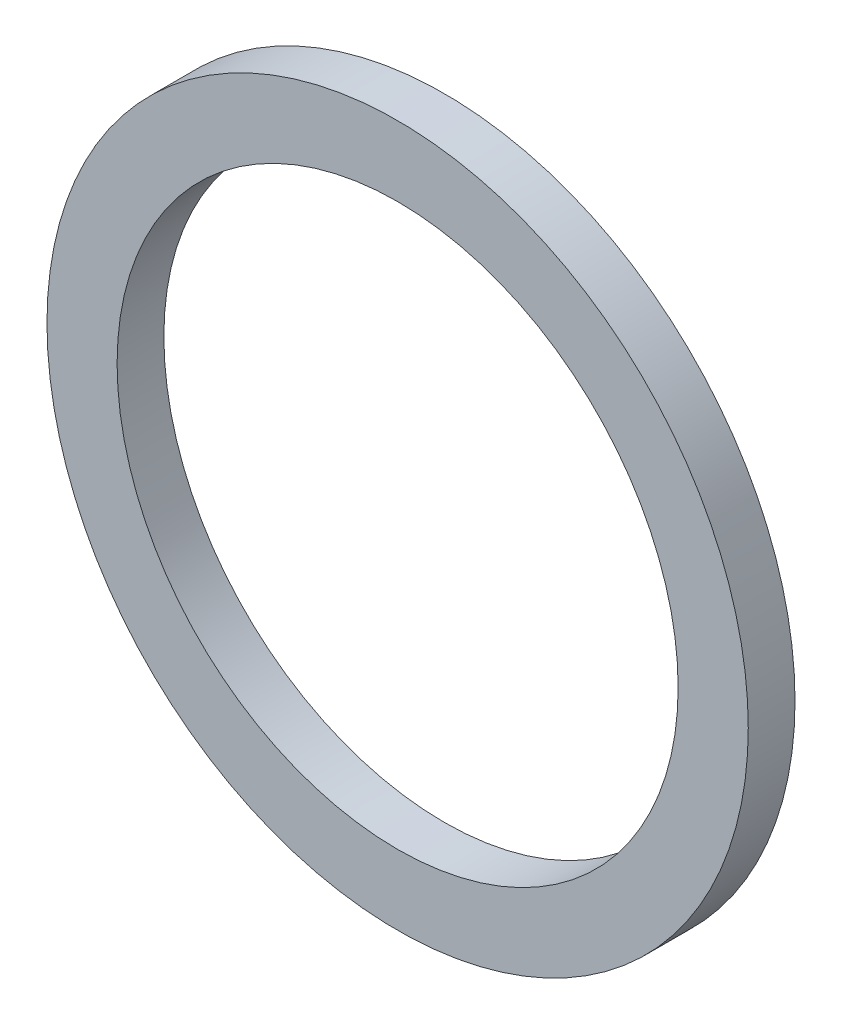
ISO-10303-21;
HEADER;
FILE_DESCRIPTION(('STEP AP214'),'2;1');
FILE_NAME('part.step','',(''),(''),'','','');
FILE_SCHEMA(('AUTOMOTIVE_DESIGN { 1 0 10303 214 1 1 1 1 }'));
ENDSEC;
DATA;
#1=APPLICATION_CONTEXT('core data for automotive mechanical design processes');
#2=APPLICATION_PROTOCOL_DEFINITION('international standard','automotive_design',2000,#1);
#3=PRODUCT_CONTEXT('',#1,'mechanical');
#4=PRODUCT('Part','Part','',(#3));
#5=PRODUCT_RELATED_PRODUCT_CATEGORY('part','',(#4));
#6=PRODUCT_DEFINITION_FORMATION('','',#4);
#7=PRODUCT_DEFINITION_CONTEXT('part definition',#1,'design');
#8=PRODUCT_DEFINITION('design','',#6,#7);
#9=PRODUCT_DEFINITION_SHAPE('','',#8);
#10=(LENGTH_UNIT() NAMED_UNIT(*) SI_UNIT(.MILLI.,.METRE.));
#11=(NAMED_UNIT(*) PLANE_ANGLE_UNIT() SI_UNIT($,.RADIAN.));
#12=(NAMED_UNIT(*) SI_UNIT($,.STERADIAN.) SOLID_ANGLE_UNIT());
#13=UNCERTAINTY_MEASURE_WITH_UNIT(LENGTH_MEASURE(1.E-05),#10,'distance_accuracy_value','');
#14=(GEOMETRIC_REPRESENTATION_CONTEXT(3) GLOBAL_UNCERTAINTY_ASSIGNED_CONTEXT((#13)) GLOBAL_UNIT_ASSIGNED_CONTEXT((#10,
#11,#12)) REPRESENTATION_CONTEXT('',''));
#15=CARTESIAN_POINT('',(0.,0.,0.));
#16=DIRECTION('',(0.,0.,1.));
#17=DIRECTION('',(1.,0.,0.));
#18=AXIS2_PLACEMENT_3D('',#15,#16,#17);
#19=CARTESIAN_POINT('',(0.,0.,2.));
#20=DIRECTION('',(0.,0.,-1.));
#21=DIRECTION('',(-1.,0.,0.));
#22=AXIS2_PLACEMENT_3D('',#19,#20,#21);
#23=CYLINDRICAL_SURFACE('',#22,15.);
#24=CARTESIAN_POINT('',(0.,0.,2.));
#25=DIRECTION('',(0.,0.,1.));
#26=DIRECTION('',(1.,0.,0.));
#27=AXIS2_PLACEMENT_3D('',#24,#25,#26);
#28=CIRCLE('',#27,15.);
#29=CARTESIAN_POINT('',(15.,0.,2.));
#30=VERTEX_POINT('',#29);
#31=EDGE_CURVE('E10',#30,#30,#28,.T.);
#32=ORIENTED_EDGE('',*,*,#31,.F.);
#33=EDGE_LOOP('',(#32));
#34=FACE_BOUND('',#33,.T.);
#35=CARTESIAN_POINT('',(0.,0.,0.));
#36=DIRECTION('',(0.,0.,1.));
#37=DIRECTION('',(1.,0.,0.));
#38=AXIS2_PLACEMENT_3D('',#35,#36,#37);
#39=CIRCLE('',#38,15.);
#40=CARTESIAN_POINT('',(15.,0.,0.));
#41=VERTEX_POINT('',#40);
#42=EDGE_CURVE('E35',#41,#41,#39,.T.);
#43=ORIENTED_EDGE('',*,*,#42,.T.);
#44=EDGE_LOOP('',(#43));
#45=FACE_BOUND('',#44,.T.);
#46=ADVANCED_FACE('F32',(#34,#45),#23,.T.);
#47=CARTESIAN_POINT('',(0.,0.,2.));
#48=DIRECTION('',(0.,0.,1.));
#49=DIRECTION('',(1.,0.,0.));
#50=AXIS2_PLACEMENT_3D('',#47,#48,#49);
#51=PLANE('',#50);
#52=CARTESIAN_POINT('',(0.,0.,2.));
#53=DIRECTION('',(0.,0.,1.));
#54=DIRECTION('',(1.,0.,0.));
#55=AXIS2_PLACEMENT_3D('',#52,#53,#54);
#56=CIRCLE('',#55,12.);
#57=CARTESIAN_POINT('',(12.,0.,2.));
#58=VERTEX_POINT('',#57);
#59=EDGE_CURVE('E44',#58,#58,#56,.T.);
#60=ORIENTED_EDGE('',*,*,#59,.F.);
#61=EDGE_LOOP('',(#60));
#62=FACE_BOUND('',#61,.T.);
#63=ORIENTED_EDGE('',*,*,#31,.T.);
#64=EDGE_LOOP('',(#63));
#65=FACE_BOUND('',#64,.T.);
#66=ADVANCED_FACE('F59',(#62,#65),#51,.T.);
#67=CARTESIAN_POINT('',(0.,0.,0.));
#68=DIRECTION('',(0.,0.,1.));
#69=DIRECTION('',(1.,0.,0.));
#70=AXIS2_PLACEMENT_3D('',#67,#68,#69);
#71=PLANE('',#70);
#72=CARTESIAN_POINT('',(0.,0.,0.));
#73=DIRECTION('',(0.,0.,1.));
#74=DIRECTION('',(1.,0.,0.));
#75=AXIS2_PLACEMENT_3D('',#72,#73,#74);
#76=CIRCLE('',#75,12.);
#77=CARTESIAN_POINT('',(12.,0.,0.));
#78=VERTEX_POINT('',#77);
#79=EDGE_CURVE('E42',#78,#78,#76,.T.);
#80=ORIENTED_EDGE('',*,*,#79,.T.);
#81=EDGE_LOOP('',(#80));
#82=FACE_BOUND('',#81,.T.);
#83=ORIENTED_EDGE('',*,*,#42,.F.);
#84=EDGE_LOOP('',(#83));
#85=FACE_BOUND('',#84,.T.);
#86=ADVANCED_FACE('F50',(#82,#85),#71,.F.);
#87=CARTESIAN_POINT('',(0.,0.,0.));
#88=DIRECTION('',(0.,0.,1.));
#89=DIRECTION('',(1.,0.,0.));
#90=AXIS2_PLACEMENT_3D('',#87,#88,#89);
#91=CYLINDRICAL_SURFACE('',#90,12.);
#92=ORIENTED_EDGE('',*,*,#79,.F.);
#93=EDGE_LOOP('',(#92));
#94=FACE_BOUND('',#93,.T.);
#95=ORIENTED_EDGE('',*,*,#59,.T.);
#96=EDGE_LOOP('',(#95));
#97=FACE_BOUND('',#96,.T.);
#98=ADVANCED_FACE('F53',(#94,#97),#91,.F.);
#99=CLOSED_SHELL('',(#46,#66,#86,#98));
#100=MANIFOLD_SOLID_BREP('B2',#99);
#101=ADVANCED_BREP_SHAPE_REPRESENTATION('',(#18,#100),#14);
#102=SHAPE_DEFINITION_REPRESENTATION(#9,#101);
ENDSEC;
END-ISO-10303-21;
